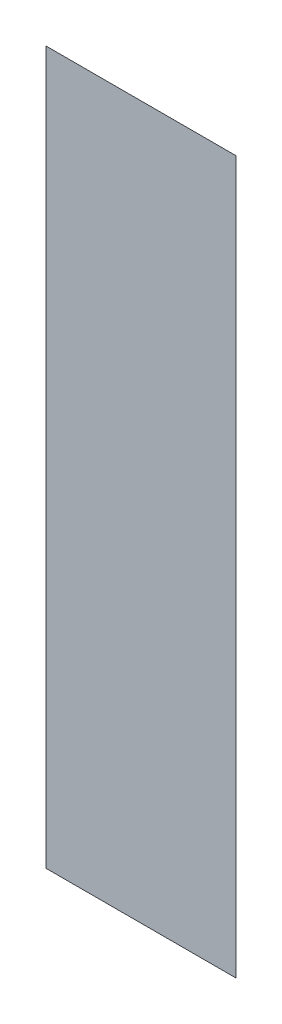
ISO-10303-21;
HEADER;
FILE_DESCRIPTION(('STEP AP214'),'2;1');
FILE_NAME('part.step','',(''),(''),'','','');
FILE_SCHEMA(('AUTOMOTIVE_DESIGN { 1 0 10303 214 1 1 1 1 }'));
ENDSEC;
DATA;
#1=APPLICATION_CONTEXT('core data for automotive mechanical design processes');
#2=APPLICATION_PROTOCOL_DEFINITION('international standard','automotive_design',2000,#1);
#3=PRODUCT_CONTEXT('',#1,'mechanical');
#4=PRODUCT('Part','Part','',(#3));
#5=PRODUCT_RELATED_PRODUCT_CATEGORY('part','',(#4));
#6=PRODUCT_DEFINITION_FORMATION('','',#4);
#7=PRODUCT_DEFINITION_CONTEXT('part definition',#1,'design');
#8=PRODUCT_DEFINITION('design','',#6,#7);
#9=PRODUCT_DEFINITION_SHAPE('','',#8);
#10=(LENGTH_UNIT() NAMED_UNIT(*) SI_UNIT(.MILLI.,.METRE.));
#11=(NAMED_UNIT(*) PLANE_ANGLE_UNIT() SI_UNIT($,.RADIAN.));
#12=(NAMED_UNIT(*) SI_UNIT($,.STERADIAN.) SOLID_ANGLE_UNIT());
#13=UNCERTAINTY_MEASURE_WITH_UNIT(LENGTH_MEASURE(1.E-05),#10,'distance_accuracy_value','');
#14=(GEOMETRIC_REPRESENTATION_CONTEXT(3) GLOBAL_UNCERTAINTY_ASSIGNED_CONTEXT((#13)) GLOBAL_UNIT_ASSIGNED_CONTEXT((#10,
#11,#12)) REPRESENTATION_CONTEXT('',''));
#15=CARTESIAN_POINT('',(0.,0.,0.));
#16=DIRECTION('',(0.,0.,1.));
#17=DIRECTION('',(1.,0.,0.));
#18=AXIS2_PLACEMENT_3D('',#15,#16,#17);
#19=CARTESIAN_POINT('',(-1.2328250745931,-0.613218987559887,0.0889425196850394));
#20=DIRECTION('',(0.,0.,1.));
#21=DIRECTION('',(0.,-1.,0.));
#22=AXIS2_PLACEMENT_3D('',#19,#20,#21);
#23=PLANE('',#22);
#24=CARTESIAN_POINT('',(-1.24340775175845,-0.615108751339415,0.0889425196850394));
#25=DIRECTION('',(1.,0.,0.));
#26=VECTOR('',#25,1.);
#27=LINE('',#24,#26);
#28=CARTESIAN_POINT('',(-1.24340775175845,-0.615108751339415,0.0890685039370079));
#29=VERTEX_POINT('',#28);
#30=CARTESIAN_POINT('',(-1.23332901160097,-0.615108751339415,0.0890685039370079));
#31=VERTEX_POINT('',#30);
#32=EDGE_CURVE('E50',#29,#31,#27,.T.);
#33=ORIENTED_EDGE('',*,*,#32,.T.);
#34=CARTESIAN_POINT('',(-1.23332901160097,-0.615108751339415,0.0889425196850394));
#35=DIRECTION('',(0.,-1.,0.));
#36=VECTOR('',#35,1.);
#37=LINE('',#34,#36);
#38=CARTESIAN_POINT('',(-1.23332901160097,-0.652904026929966,0.0890685039370079));
#39=VERTEX_POINT('',#38);
#40=EDGE_CURVE('E28',#31,#39,#37,.T.);
#41=ORIENTED_EDGE('',*,*,#40,.T.);
#42=CARTESIAN_POINT('',(-1.23332901160097,-0.652904026929966,0.0889425196850394));
#43=DIRECTION('',(-1.,0.,0.));
#44=VECTOR('',#43,1.);
#45=LINE('',#42,#44);
#46=CARTESIAN_POINT('',(-1.24340775175845,-0.652904026929966,0.0890685039370079));
#47=VERTEX_POINT('',#46);
#48=EDGE_CURVE('E11',#39,#47,#45,.T.);
#49=ORIENTED_EDGE('',*,*,#48,.T.);
#50=CARTESIAN_POINT('',(-1.24340775175845,-0.652904026929966,0.0889425196850394));
#51=DIRECTION('',(0.,1.,0.));
#52=VECTOR('',#51,1.);
#53=LINE('',#50,#52);
#54=EDGE_CURVE('E41',#47,#29,#53,.T.);
#55=ORIENTED_EDGE('',*,*,#54,.T.);
#56=EDGE_LOOP('',(#33,#41,#49,#55));
#57=FACE_BOUND('',#56,.T.);
#58=ADVANCED_FACE('F17',(#57),#23,.F.);
#59=CARTESIAN_POINT('',(-1.2328250745931,-0.613218987559887,0.0891944881889764));
#60=DIRECTION('',(0.,0.,1.));
#61=DIRECTION('',(0.,-1.,0.));
#62=AXIS2_PLACEMENT_3D('',#59,#60,#61);
#63=PLANE('',#62);
#64=ORIENTED_EDGE('',*,*,#40,.F.);
#65=ORIENTED_EDGE('',*,*,#32,.F.);
#66=ORIENTED_EDGE('',*,*,#54,.F.);
#67=ORIENTED_EDGE('',*,*,#48,.F.);
#68=EDGE_LOOP('',(#64,#65,#66,#67));
#69=FACE_BOUND('',#68,.T.);
#70=ADVANCED_FACE('F49',(#69),#63,.T.);
#71=CLOSED_SHELL('',(#58,#70));
#72=MANIFOLD_SOLID_BREP('B1',#71);
#73=ADVANCED_BREP_SHAPE_REPRESENTATION('',(#18,#72),#14);
#74=SHAPE_DEFINITION_REPRESENTATION(#9,#73);
ENDSEC;
END-ISO-10303-21;
